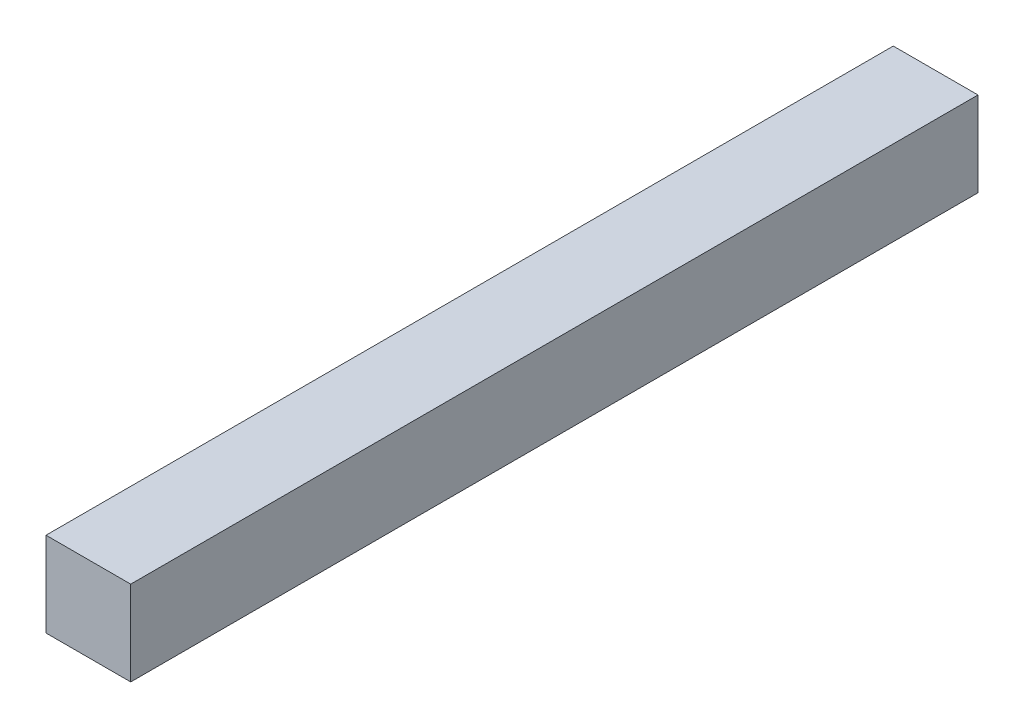
ISO-10303-21;
HEADER;
FILE_DESCRIPTION(('STEP AP214'),'2;1');
FILE_NAME('part.step','',(''),(''),'','','');
FILE_SCHEMA(('AUTOMOTIVE_DESIGN { 1 0 10303 214 1 1 1 1 }'));
ENDSEC;
DATA;
#1=APPLICATION_CONTEXT('core data for automotive mechanical design processes');
#2=APPLICATION_PROTOCOL_DEFINITION('international standard','automotive_design',2000,#1);
#3=PRODUCT_CONTEXT('',#1,'mechanical');
#4=PRODUCT('Part','Part','',(#3));
#5=PRODUCT_RELATED_PRODUCT_CATEGORY('part','',(#4));
#6=PRODUCT_DEFINITION_FORMATION('','',#4);
#7=PRODUCT_DEFINITION_CONTEXT('part definition',#1,'design');
#8=PRODUCT_DEFINITION('design','',#6,#7);
#9=PRODUCT_DEFINITION_SHAPE('','',#8);
#10=(LENGTH_UNIT() NAMED_UNIT(*) SI_UNIT(.MILLI.,.METRE.));
#11=(NAMED_UNIT(*) PLANE_ANGLE_UNIT() SI_UNIT($,.RADIAN.));
#12=(NAMED_UNIT(*) SI_UNIT($,.STERADIAN.) SOLID_ANGLE_UNIT());
#13=UNCERTAINTY_MEASURE_WITH_UNIT(LENGTH_MEASURE(1.E-05),#10,'distance_accuracy_value','');
#14=(GEOMETRIC_REPRESENTATION_CONTEXT(3) GLOBAL_UNCERTAINTY_ASSIGNED_CONTEXT((#13)) GLOBAL_UNIT_ASSIGNED_CONTEXT((#10,
#11,#12)) REPRESENTATION_CONTEXT('',''));
#15=CARTESIAN_POINT('',(0.,0.,0.));
#16=DIRECTION('',(0.,0.,1.));
#17=DIRECTION('',(1.,0.,0.));
#18=AXIS2_PLACEMENT_3D('',#15,#16,#17);
#19=CARTESIAN_POINT('',(0.,0.,50.));
#20=DIRECTION('',(1.,0.,0.));
#21=DIRECTION('',(0.,0.,-1.));
#22=AXIS2_PLACEMENT_3D('',#19,#20,#21);
#23=PLANE('',#22);
#24=DIRECTION('',(0.,-1.,0.));
#25=VECTOR('',#24,1.);
#26=CARTESIAN_POINT('',(0.,0.,0.));
#27=LINE('',#26,#25);
#28=CARTESIAN_POINT('',(0.,5.,0.));
#29=VERTEX_POINT('',#28);
#30=CARTESIAN_POINT('',(0.,0.,0.));
#31=VERTEX_POINT('',#30);
#32=EDGE_CURVE('E95',#29,#31,#27,.T.);
#33=ORIENTED_EDGE('',*,*,#32,.T.);
#34=DIRECTION('',(0.,0.,-1.));
#35=VECTOR('',#34,1.);
#36=CARTESIAN_POINT('',(0.,0.,50.));
#37=LINE('',#36,#35);
#38=CARTESIAN_POINT('',(0.,0.,50.));
#39=VERTEX_POINT('',#38);
#40=EDGE_CURVE('E11',#39,#31,#37,.T.);
#41=ORIENTED_EDGE('',*,*,#40,.F.);
#42=DIRECTION('',(0.,-1.,0.));
#43=VECTOR('',#42,1.);
#44=CARTESIAN_POINT('',(0.,0.,50.));
#45=LINE('',#44,#43);
#46=CARTESIAN_POINT('',(0.,5.,50.));
#47=VERTEX_POINT('',#46);
#48=EDGE_CURVE('E83',#47,#39,#45,.T.);
#49=ORIENTED_EDGE('',*,*,#48,.F.);
#50=DIRECTION('',(0.,0.,-1.));
#51=VECTOR('',#50,1.);
#52=CARTESIAN_POINT('',(0.,5.,50.));
#53=LINE('',#52,#51);
#54=EDGE_CURVE('E91',#47,#29,#53,.T.);
#55=ORIENTED_EDGE('',*,*,#54,.T.);
#56=EDGE_LOOP('',(#33,#41,#49,#55));
#57=FACE_BOUND('',#56,.T.);
#58=ADVANCED_FACE('F32',(#57),#23,.F.);
#59=CARTESIAN_POINT('',(0.,0.,50.));
#60=DIRECTION('',(0.,1.,0.));
#61=DIRECTION('',(0.,0.,1.));
#62=AXIS2_PLACEMENT_3D('',#59,#60,#61);
#63=PLANE('',#62);
#64=DIRECTION('',(1.,0.,0.));
#65=VECTOR('',#64,1.);
#66=CARTESIAN_POINT('',(0.,0.,0.));
#67=LINE('',#66,#65);
#68=CARTESIAN_POINT('',(5.,0.,0.));
#69=VERTEX_POINT('',#68);
#70=EDGE_CURVE('E87',#31,#69,#67,.T.);
#71=ORIENTED_EDGE('',*,*,#70,.T.);
#72=DIRECTION('',(0.,0.,-1.));
#73=VECTOR('',#72,1.);
#74=CARTESIAN_POINT('',(5.,0.,50.));
#75=LINE('',#74,#73);
#76=CARTESIAN_POINT('',(5.,0.,50.));
#77=VERTEX_POINT('',#76);
#78=EDGE_CURVE('E40',#77,#69,#75,.T.);
#79=ORIENTED_EDGE('',*,*,#78,.F.);
#80=DIRECTION('',(1.,0.,0.));
#81=VECTOR('',#80,1.);
#82=CARTESIAN_POINT('',(0.,0.,50.));
#83=LINE('',#82,#81);
#84=EDGE_CURVE('E78',#39,#77,#83,.T.);
#85=ORIENTED_EDGE('',*,*,#84,.F.);
#86=ORIENTED_EDGE('',*,*,#40,.T.);
#87=EDGE_LOOP('',(#71,#79,#85,#86));
#88=FACE_BOUND('',#87,.T.);
#89=ADVANCED_FACE('F86',(#88),#63,.F.);
#90=CARTESIAN_POINT('',(5.,0.,50.));
#91=DIRECTION('',(-1.,0.,0.));
#92=DIRECTION('',(0.,0.,1.));
#93=AXIS2_PLACEMENT_3D('',#90,#91,#92);
#94=PLANE('',#93);
#95=DIRECTION('',(0.,1.,0.));
#96=VECTOR('',#95,1.);
#97=CARTESIAN_POINT('',(5.,0.,0.));
#98=LINE('',#97,#96);
#99=CARTESIAN_POINT('',(5.,5.,0.));
#100=VERTEX_POINT('',#99);
#101=EDGE_CURVE('E65',#69,#100,#98,.T.);
#102=ORIENTED_EDGE('',*,*,#101,.T.);
#103=DIRECTION('',(0.,0.,-1.));
#104=VECTOR('',#103,1.);
#105=CARTESIAN_POINT('',(5.,5.,50.));
#106=LINE('',#105,#104);
#107=CARTESIAN_POINT('',(5.,5.,50.));
#108=VERTEX_POINT('',#107);
#109=EDGE_CURVE('E88',#108,#100,#106,.T.);
#110=ORIENTED_EDGE('',*,*,#109,.F.);
#111=DIRECTION('',(0.,1.,0.));
#112=VECTOR('',#111,1.);
#113=CARTESIAN_POINT('',(5.,0.,50.));
#114=LINE('',#113,#112);
#115=EDGE_CURVE('E81',#77,#108,#114,.T.);
#116=ORIENTED_EDGE('',*,*,#115,.F.);
#117=ORIENTED_EDGE('',*,*,#78,.T.);
#118=EDGE_LOOP('',(#102,#110,#116,#117));
#119=FACE_BOUND('',#118,.T.);
#120=ADVANCED_FACE('F89',(#119),#94,.F.);
#121=CARTESIAN_POINT('',(0.,5.,50.));
#122=DIRECTION('',(0.,-1.,0.));
#123=DIRECTION('',(0.,0.,-1.));
#124=AXIS2_PLACEMENT_3D('',#121,#122,#123);
#125=PLANE('',#124);
#126=DIRECTION('',(-1.,0.,0.));
#127=VECTOR('',#126,1.);
#128=CARTESIAN_POINT('',(0.,5.,0.));
#129=LINE('',#128,#127);
#130=EDGE_CURVE('E71',#100,#29,#129,.T.);
#131=ORIENTED_EDGE('',*,*,#130,.T.);
#132=ORIENTED_EDGE('',*,*,#54,.F.);
#133=DIRECTION('',(-1.,0.,0.));
#134=VECTOR('',#133,1.);
#135=CARTESIAN_POINT('',(0.,5.,50.));
#136=LINE('',#135,#134);
#137=EDGE_CURVE('E48',#108,#47,#136,.T.);
#138=ORIENTED_EDGE('',*,*,#137,.F.);
#139=ORIENTED_EDGE('',*,*,#109,.T.);
#140=EDGE_LOOP('',(#131,#132,#138,#139));
#141=FACE_BOUND('',#140,.T.);
#142=ADVANCED_FACE('F102',(#141),#125,.F.);
#143=CARTESIAN_POINT('',(0.,5.,50.));
#144=DIRECTION('',(0.,0.,-1.));
#145=DIRECTION('',(-1.,0.,0.));
#146=AXIS2_PLACEMENT_3D('',#143,#144,#145);
#147=PLANE('',#146);
#148=ORIENTED_EDGE('',*,*,#48,.T.);
#149=ORIENTED_EDGE('',*,*,#84,.T.);
#150=ORIENTED_EDGE('',*,*,#115,.T.);
#151=ORIENTED_EDGE('',*,*,#137,.T.);
#152=EDGE_LOOP('',(#148,#149,#150,#151));
#153=FACE_BOUND('',#152,.T.);
#154=ADVANCED_FACE('F79',(#153),#147,.F.);
#155=CARTESIAN_POINT('',(0.,5.,0.));
#156=DIRECTION('',(0.,0.,-1.));
#157=DIRECTION('',(-1.,0.,0.));
#158=AXIS2_PLACEMENT_3D('',#155,#156,#157);
#159=PLANE('',#158);
#160=ORIENTED_EDGE('',*,*,#32,.F.);
#161=ORIENTED_EDGE('',*,*,#130,.F.);
#162=ORIENTED_EDGE('',*,*,#101,.F.);
#163=ORIENTED_EDGE('',*,*,#70,.F.);
#164=EDGE_LOOP('',(#160,#161,#162,#163));
#165=FACE_BOUND('',#164,.T.);
#166=ADVANCED_FACE('F105',(#165),#159,.T.);
#167=CLOSED_SHELL('',(#58,#89,#120,#142,#154,#166));
#168=MANIFOLD_SOLID_BREP('B2',#167);
#169=ADVANCED_BREP_SHAPE_REPRESENTATION('',(#18,#168),#14);
#170=SHAPE_DEFINITION_REPRESENTATION(#9,#169);
ENDSEC;
END-ISO-10303-21;
